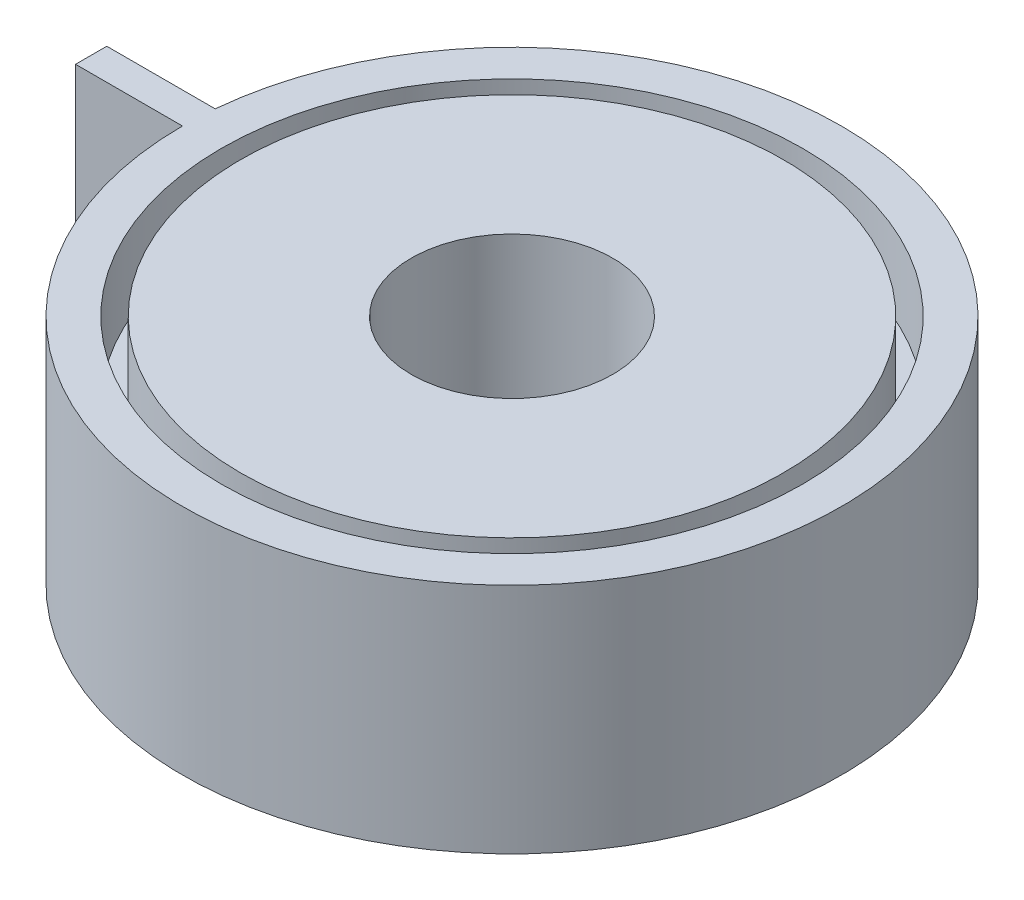
ISO-10303-21;
HEADER;
FILE_DESCRIPTION(('STEP AP214'),'2;1');
FILE_NAME('part.step','',(''),(''),'','','');
FILE_SCHEMA(('AUTOMOTIVE_DESIGN { 1 0 10303 214 1 1 1 1 }'));
ENDSEC;
DATA;
#1=APPLICATION_CONTEXT('core data for automotive mechanical design processes');
#2=APPLICATION_PROTOCOL_DEFINITION('international standard','automotive_design',2000,#1);
#3=PRODUCT_CONTEXT('',#1,'mechanical');
#4=PRODUCT('Part','Part','',(#3));
#5=PRODUCT_RELATED_PRODUCT_CATEGORY('part','',(#4));
#6=PRODUCT_DEFINITION_FORMATION('','',#4);
#7=PRODUCT_DEFINITION_CONTEXT('part definition',#1,'design');
#8=PRODUCT_DEFINITION('design','',#6,#7);
#9=PRODUCT_DEFINITION_SHAPE('','',#8);
#10=(LENGTH_UNIT() NAMED_UNIT(*) SI_UNIT(.MILLI.,.METRE.));
#11=(NAMED_UNIT(*) PLANE_ANGLE_UNIT() SI_UNIT($,.RADIAN.));
#12=(NAMED_UNIT(*) SI_UNIT($,.STERADIAN.) SOLID_ANGLE_UNIT());
#13=UNCERTAINTY_MEASURE_WITH_UNIT(LENGTH_MEASURE(1.E-05),#10,'distance_accuracy_value','');
#14=(GEOMETRIC_REPRESENTATION_CONTEXT(3) GLOBAL_UNCERTAINTY_ASSIGNED_CONTEXT((#13)) GLOBAL_UNIT_ASSIGNED_CONTEXT((#10,
#11,#12)) REPRESENTATION_CONTEXT('',''));
#15=CARTESIAN_POINT('',(0.,0.,0.));
#16=DIRECTION('',(0.,0.,1.));
#17=DIRECTION('',(1.,0.,0.));
#18=AXIS2_PLACEMENT_3D('',#15,#16,#17);
#19=CARTESIAN_POINT('',(0.,60.,0.));
#20=DIRECTION('',(0.,1.,0.));
#21=DIRECTION('',(0.,0.,1.));
#22=AXIS2_PLACEMENT_3D('',#19,#20,#21);
#23=PLANE('',#22);
#24=CARTESIAN_POINT('',(0.,60.,0.));
#25=DIRECTION('',(0.,1.,0.));
#26=DIRECTION('',(0.,0.,1.));
#27=AXIS2_PLACEMENT_3D('',#24,#25,#26);
#28=CIRCLE('',#27,26.);
#29=CARTESIAN_POINT('',(0.,60.,26.));
#30=VERTEX_POINT('',#29);
#31=EDGE_CURVE('E128',#30,#30,#28,.T.);
#32=ORIENTED_EDGE('',*,*,#31,.F.);
#33=EDGE_LOOP('',(#32));
#34=FACE_BOUND('',#33,.T.);
#35=CARTESIAN_POINT('',(0.,60.,0.));
#36=DIRECTION('',(0.,1.,0.));
#37=DIRECTION('',(0.,0.,1.));
#38=AXIS2_PLACEMENT_3D('',#35,#36,#37);
#39=CIRCLE('',#38,70.);
#40=CARTESIAN_POINT('',(0.,60.,70.));
#41=VERTEX_POINT('',#40);
#42=EDGE_CURVE('E177',#41,#41,#39,.T.);
#43=ORIENTED_EDGE('',*,*,#42,.T.);
#44=EDGE_LOOP('',(#43));
#45=FACE_BOUND('',#44,.T.);
#46=ADVANCED_FACE('F55',(#34,#45),#23,.T.);
#47=CARTESIAN_POINT('',(0.,0.,0.));
#48=DIRECTION('',(0.,1.,0.));
#49=DIRECTION('',(0.,0.,1.));
#50=AXIS2_PLACEMENT_3D('',#47,#48,#49);
#51=PLANE('',#50);
#52=CARTESIAN_POINT('',(0.,0.,0.));
#53=DIRECTION('',(0.,1.,0.));
#54=DIRECTION('',(0.,0.,1.));
#55=AXIS2_PLACEMENT_3D('',#52,#53,#54);
#56=CIRCLE('',#55,26.);
#57=CARTESIAN_POINT('',(0.,0.,26.));
#58=VERTEX_POINT('',#57);
#59=EDGE_CURVE('E145',#58,#58,#56,.T.);
#60=ORIENTED_EDGE('',*,*,#59,.T.);
#61=EDGE_LOOP('',(#60));
#62=FACE_BOUND('',#61,.T.);
#63=CARTESIAN_POINT('',(0.,0.,0.));
#64=DIRECTION('',(0.,-1.,0.));
#65=DIRECTION('',(0.,0.,-1.));
#66=AXIS2_PLACEMENT_3D('',#63,#64,#65);
#67=CIRCLE('',#66,70.);
#68=CARTESIAN_POINT('',(0.,0.,-70.));
#69=VERTEX_POINT('',#68);
#70=EDGE_CURVE('E161',#69,#69,#67,.T.);
#71=ORIENTED_EDGE('',*,*,#70,.T.);
#72=EDGE_LOOP('',(#71));
#73=FACE_BOUND('',#72,.T.);
#74=ADVANCED_FACE('F202',(#62,#73),#51,.F.);
#75=CARTESIAN_POINT('',(0.,60.,0.));
#76=DIRECTION('',(0.,1.,0.));
#77=DIRECTION('',(0.,0.,1.));
#78=AXIS2_PLACEMENT_3D('',#75,#76,#77);
#79=CIRCLE('',#78,75.);
#80=CARTESIAN_POINT('',(0.,60.,75.));
#81=VERTEX_POINT('',#80);
#82=EDGE_CURVE('E169',#81,#81,#79,.T.);
#83=ORIENTED_EDGE('',*,*,#82,.F.);
#84=EDGE_LOOP('',(#83));
#85=FACE_BOUND('',#84,.T.);
#86=CARTESIAN_POINT('',(0.,60.,0.));
#87=DIRECTION('',(0.,1.,0.));
#88=DIRECTION('',(0.,0.,1.));
#89=AXIS2_PLACEMENT_3D('',#86,#87,#88);
#90=CIRCLE('',#89,85.);
#91=CARTESIAN_POINT('',(-85.,60.,0.));
#92=VERTEX_POINT('',#91);
#93=CARTESIAN_POINT('',(-84.6170668633372,60.,-8.05928008233536));
#94=VERTEX_POINT('',#93);
#95=EDGE_CURVE('E108',#92,#94,#90,.T.);
#96=ORIENTED_EDGE('',*,*,#95,.T.);
#97=DIRECTION('',(-1.,0.,0.));
#98=VECTOR('',#97,1.);
#99=CARTESIAN_POINT('',(-112.580048143794,60.,-8.05928008233536));
#100=LINE('',#99,#98);
#101=CARTESIAN_POINT('',(-112.580048143794,60.,-8.05928008233536));
#102=VERTEX_POINT('',#101);
#103=EDGE_CURVE('E103',#94,#102,#100,.T.);
#104=ORIENTED_EDGE('',*,*,#103,.T.);
#105=DIRECTION('',(0.,0.,1.));
#106=VECTOR('',#105,1.);
#107=CARTESIAN_POINT('',(-112.580048143794,60.,0.));
#108=LINE('',#107,#106);
#109=CARTESIAN_POINT('',(-112.580048143794,60.,0.));
#110=VERTEX_POINT('',#109);
#111=EDGE_CURVE('E106',#102,#110,#108,.T.);
#112=ORIENTED_EDGE('',*,*,#111,.T.);
#113=DIRECTION('',(1.,0.,0.));
#114=VECTOR('',#113,1.);
#115=CARTESIAN_POINT('',(-85.,60.,0.));
#116=LINE('',#115,#114);
#117=EDGE_CURVE('E73',#110,#92,#116,.T.);
#118=ORIENTED_EDGE('',*,*,#117,.T.);
#119=EDGE_LOOP('',(#96,#104,#112,#118));
#120=FACE_BOUND('',#119,.T.);
#121=ADVANCED_FACE('F104',(#85,#120),#23,.T.);
#122=CARTESIAN_POINT('',(0.,0.,0.));
#123=DIRECTION('',(0.,-1.,0.));
#124=DIRECTION('',(0.,0.,-1.));
#125=AXIS2_PLACEMENT_3D('',#122,#123,#124);
#126=CIRCLE('',#125,75.);
#127=CARTESIAN_POINT('',(0.,0.,-75.));
#128=VERTEX_POINT('',#127);
#129=EDGE_CURVE('E153',#128,#128,#126,.T.);
#130=ORIENTED_EDGE('',*,*,#129,.F.);
#131=EDGE_LOOP('',(#130));
#132=FACE_BOUND('',#131,.T.);
#133=CARTESIAN_POINT('',(0.,0.,0.));
#134=DIRECTION('',(0.,1.,0.));
#135=DIRECTION('',(0.,0.,1.));
#136=AXIS2_PLACEMENT_3D('',#133,#134,#135);
#137=CIRCLE('',#136,85.);
#138=CARTESIAN_POINT('',(-85.,0.,0.));
#139=VERTEX_POINT('',#138);
#140=CARTESIAN_POINT('',(-84.6170668633372,0.,-8.05928008233536));
#141=VERTEX_POINT('',#140);
#142=EDGE_CURVE('E124',#139,#141,#137,.T.);
#143=ORIENTED_EDGE('',*,*,#142,.F.);
#144=DIRECTION('',(1.,0.,0.));
#145=VECTOR('',#144,1.);
#146=CARTESIAN_POINT('',(-85.,0.,0.));
#147=LINE('',#146,#145);
#148=CARTESIAN_POINT('',(-112.580048143794,0.,0.));
#149=VERTEX_POINT('',#148);
#150=EDGE_CURVE('E96',#149,#139,#147,.T.);
#151=ORIENTED_EDGE('',*,*,#150,.F.);
#152=DIRECTION('',(0.,0.,1.));
#153=VECTOR('',#152,1.);
#154=CARTESIAN_POINT('',(-112.580048143794,0.,0.));
#155=LINE('',#154,#153);
#156=CARTESIAN_POINT('',(-112.580048143794,0.,-8.05928008233536));
#157=VERTEX_POINT('',#156);
#158=EDGE_CURVE('E90',#157,#149,#155,.T.);
#159=ORIENTED_EDGE('',*,*,#158,.F.);
#160=DIRECTION('',(-1.,0.,0.));
#161=VECTOR('',#160,1.);
#162=CARTESIAN_POINT('',(-112.580048143794,0.,-8.05928008233536));
#163=LINE('',#162,#161);
#164=EDGE_CURVE('E113',#141,#157,#163,.T.);
#165=ORIENTED_EDGE('',*,*,#164,.F.);
#166=EDGE_LOOP('',(#143,#151,#159,#165));
#167=FACE_BOUND('',#166,.T.);
#168=ADVANCED_FACE('F141',(#132,#167),#51,.F.);
#169=CARTESIAN_POINT('',(0.,60.,0.));
#170=DIRECTION('',(0.,-1.,0.));
#171=DIRECTION('',(0.,0.,-1.));
#172=AXIS2_PLACEMENT_3D('',#169,#170,#171);
#173=CYLINDRICAL_SURFACE('',#172,85.);
#174=ORIENTED_EDGE('',*,*,#142,.T.);
#175=DIRECTION('',(0.,-1.,0.));
#176=VECTOR('',#175,1.);
#177=CARTESIAN_POINT('',(-84.6170668633372,60.,-8.05928008233536));
#178=LINE('',#177,#176);
#179=EDGE_CURVE('E12',#94,#141,#178,.T.);
#180=ORIENTED_EDGE('',*,*,#179,.F.);
#181=ORIENTED_EDGE('',*,*,#95,.F.);
#182=DIRECTION('',(0.,-1.,0.));
#183=VECTOR('',#182,1.);
#184=CARTESIAN_POINT('',(-85.,60.,0.));
#185=LINE('',#184,#183);
#186=EDGE_CURVE('E120',#92,#139,#185,.T.);
#187=ORIENTED_EDGE('',*,*,#186,.T.);
#188=EDGE_LOOP('',(#174,#180,#181,#187));
#189=FACE_BOUND('',#188,.T.);
#190=ADVANCED_FACE('F57',(#189),#173,.T.);
#191=CARTESIAN_POINT('',(-112.580048143794,60.,-8.05928008233536));
#192=DIRECTION('',(0.,0.,1.));
#193=DIRECTION('',(1.,0.,0.));
#194=AXIS2_PLACEMENT_3D('',#191,#192,#193);
#195=PLANE('',#194);
#196=ORIENTED_EDGE('',*,*,#164,.T.);
#197=DIRECTION('',(0.,-1.,0.));
#198=VECTOR('',#197,1.);
#199=CARTESIAN_POINT('',(-112.580048143794,60.,-8.05928008233536));
#200=LINE('',#199,#198);
#201=EDGE_CURVE('E65',#102,#157,#200,.T.);
#202=ORIENTED_EDGE('',*,*,#201,.F.);
#203=ORIENTED_EDGE('',*,*,#103,.F.);
#204=ORIENTED_EDGE('',*,*,#179,.T.);
#205=EDGE_LOOP('',(#196,#202,#203,#204));
#206=FACE_BOUND('',#205,.T.);
#207=ADVANCED_FACE('F112',(#206),#195,.F.);
#208=CARTESIAN_POINT('',(-112.580048143794,60.,0.));
#209=DIRECTION('',(1.,0.,0.));
#210=DIRECTION('',(0.,0.,-1.));
#211=AXIS2_PLACEMENT_3D('',#208,#209,#210);
#212=PLANE('',#211);
#213=ORIENTED_EDGE('',*,*,#158,.T.);
#214=DIRECTION('',(0.,-1.,0.));
#215=VECTOR('',#214,1.);
#216=CARTESIAN_POINT('',(-112.580048143794,60.,0.));
#217=LINE('',#216,#215);
#218=EDGE_CURVE('E115',#110,#149,#217,.T.);
#219=ORIENTED_EDGE('',*,*,#218,.F.);
#220=ORIENTED_EDGE('',*,*,#111,.F.);
#221=ORIENTED_EDGE('',*,*,#201,.T.);
#222=EDGE_LOOP('',(#213,#219,#220,#221));
#223=FACE_BOUND('',#222,.T.);
#224=ADVANCED_FACE('F116',(#223),#212,.F.);
#225=CARTESIAN_POINT('',(-85.,60.,0.));
#226=DIRECTION('',(0.,0.,-1.));
#227=DIRECTION('',(-1.,0.,0.));
#228=AXIS2_PLACEMENT_3D('',#225,#226,#227);
#229=PLANE('',#228);
#230=ORIENTED_EDGE('',*,*,#150,.T.);
#231=ORIENTED_EDGE('',*,*,#186,.F.);
#232=ORIENTED_EDGE('',*,*,#117,.F.);
#233=ORIENTED_EDGE('',*,*,#218,.T.);
#234=EDGE_LOOP('',(#230,#231,#232,#233));
#235=FACE_BOUND('',#234,.T.);
#236=ADVANCED_FACE('F138',(#235),#229,.F.);
#237=CARTESIAN_POINT('',(0.,60.,0.));
#238=DIRECTION('',(0.,-1.,0.));
#239=DIRECTION('',(0.,0.,-1.));
#240=AXIS2_PLACEMENT_3D('',#237,#238,#239);
#241=CYLINDRICAL_SURFACE('',#240,26.);
#242=ORIENTED_EDGE('',*,*,#31,.T.);
#243=EDGE_LOOP('',(#242));
#244=FACE_BOUND('',#243,.T.);
#245=ORIENTED_EDGE('',*,*,#59,.F.);
#246=EDGE_LOOP('',(#245));
#247=FACE_BOUND('',#246,.T.);
#248=ADVANCED_FACE('F233',(#244,#247),#241,.F.);
#249=CARTESIAN_POINT('',(0.,20.,0.));
#250=DIRECTION('',(0.,-1.,0.));
#251=DIRECTION('',(0.,0.,-1.));
#252=AXIS2_PLACEMENT_3D('',#249,#250,#251);
#253=CYLINDRICAL_SURFACE('',#252,75.);
#254=CARTESIAN_POINT('',(0.,20.,0.));
#255=DIRECTION('',(0.,-1.,0.));
#256=DIRECTION('',(0.,0.,-1.));
#257=AXIS2_PLACEMENT_3D('',#254,#255,#256);
#258=CIRCLE('',#257,75.);
#259=CARTESIAN_POINT('',(0.,20.,-75.));
#260=VERTEX_POINT('',#259);
#261=EDGE_CURVE('E149',#260,#260,#258,.T.);
#262=ORIENTED_EDGE('',*,*,#261,.F.);
#263=EDGE_LOOP('',(#262));
#264=FACE_BOUND('',#263,.T.);
#265=ORIENTED_EDGE('',*,*,#129,.T.);
#266=EDGE_LOOP('',(#265));
#267=FACE_BOUND('',#266,.T.);
#268=ADVANCED_FACE('F230',(#264,#267),#253,.F.);
#269=CARTESIAN_POINT('',(0.,20.,0.));
#270=DIRECTION('',(0.,-1.,0.));
#271=DIRECTION('',(0.,0.,-1.));
#272=AXIS2_PLACEMENT_3D('',#269,#270,#271);
#273=PLANE('',#272);
#274=CARTESIAN_POINT('',(0.,20.,0.));
#275=DIRECTION('',(0.,-1.,0.));
#276=DIRECTION('',(0.,0.,-1.));
#277=AXIS2_PLACEMENT_3D('',#274,#275,#276);
#278=CIRCLE('',#277,70.);
#279=CARTESIAN_POINT('',(0.,20.,-70.));
#280=VERTEX_POINT('',#279);
#281=EDGE_CURVE('E157',#280,#280,#278,.T.);
#282=ORIENTED_EDGE('',*,*,#281,.F.);
#283=EDGE_LOOP('',(#282));
#284=FACE_BOUND('',#283,.T.);
#285=ORIENTED_EDGE('',*,*,#261,.T.);
#286=EDGE_LOOP('',(#285));
#287=FACE_BOUND('',#286,.T.);
#288=ADVANCED_FACE('F226',(#284,#287),#273,.T.);
#289=CARTESIAN_POINT('',(0.,20.,0.));
#290=DIRECTION('',(0.,-1.,0.));
#291=DIRECTION('',(0.,0.,-1.));
#292=AXIS2_PLACEMENT_3D('',#289,#290,#291);
#293=CYLINDRICAL_SURFACE('',#292,70.);
#294=ORIENTED_EDGE('',*,*,#281,.T.);
#295=EDGE_LOOP('',(#294));
#296=FACE_BOUND('',#295,.T.);
#297=ORIENTED_EDGE('',*,*,#70,.F.);
#298=EDGE_LOOP('',(#297));
#299=FACE_BOUND('',#298,.T.);
#300=ADVANCED_FACE('F197',(#296,#299),#293,.T.);
#301=CARTESIAN_POINT('',(0.,40.,0.));
#302=DIRECTION('',(0.,1.,0.));
#303=DIRECTION('',(0.,0.,1.));
#304=AXIS2_PLACEMENT_3D('',#301,#302,#303);
#305=CYLINDRICAL_SURFACE('',#304,75.);
#306=CARTESIAN_POINT('',(0.,40.,0.));
#307=DIRECTION('',(0.,1.,0.));
#308=DIRECTION('',(0.,0.,1.));
#309=AXIS2_PLACEMENT_3D('',#306,#307,#308);
#310=CIRCLE('',#309,75.);
#311=CARTESIAN_POINT('',(0.,40.,75.));
#312=VERTEX_POINT('',#311);
#313=EDGE_CURVE('E165',#312,#312,#310,.T.);
#314=ORIENTED_EDGE('',*,*,#313,.F.);
#315=EDGE_LOOP('',(#314));
#316=FACE_BOUND('',#315,.T.);
#317=ORIENTED_EDGE('',*,*,#82,.T.);
#318=EDGE_LOOP('',(#317));
#319=FACE_BOUND('',#318,.T.);
#320=ADVANCED_FACE('F191',(#316,#319),#305,.F.);
#321=CARTESIAN_POINT('',(0.,40.,0.));
#322=DIRECTION('',(0.,1.,0.));
#323=DIRECTION('',(0.,0.,1.));
#324=AXIS2_PLACEMENT_3D('',#321,#322,#323);
#325=PLANE('',#324);
#326=CARTESIAN_POINT('',(0.,40.,0.));
#327=DIRECTION('',(0.,1.,0.));
#328=DIRECTION('',(0.,0.,1.));
#329=AXIS2_PLACEMENT_3D('',#326,#327,#328);
#330=CIRCLE('',#329,70.);
#331=CARTESIAN_POINT('',(0.,40.,70.));
#332=VERTEX_POINT('',#331);
#333=EDGE_CURVE('E173',#332,#332,#330,.T.);
#334=ORIENTED_EDGE('',*,*,#333,.F.);
#335=EDGE_LOOP('',(#334));
#336=FACE_BOUND('',#335,.T.);
#337=ORIENTED_EDGE('',*,*,#313,.T.);
#338=EDGE_LOOP('',(#337));
#339=FACE_BOUND('',#338,.T.);
#340=ADVANCED_FACE('F188',(#336,#339),#325,.T.);
#341=CARTESIAN_POINT('',(0.,40.,0.));
#342=DIRECTION('',(0.,1.,0.));
#343=DIRECTION('',(0.,0.,1.));
#344=AXIS2_PLACEMENT_3D('',#341,#342,#343);
#345=CYLINDRICAL_SURFACE('',#344,70.);
#346=ORIENTED_EDGE('',*,*,#333,.T.);
#347=EDGE_LOOP('',(#346));
#348=FACE_BOUND('',#347,.T.);
#349=ORIENTED_EDGE('',*,*,#42,.F.);
#350=EDGE_LOOP('',(#349));
#351=FACE_BOUND('',#350,.T.);
#352=ADVANCED_FACE('F185',(#348,#351),#345,.T.);
#353=CLOSED_SHELL('',(#46,#74,#121,#168,#190,#207,#224,#236,#248,#268,#288,#300,#320,#340,#352));
#354=MANIFOLD_SOLID_BREP('B2',#353);
#355=ADVANCED_BREP_SHAPE_REPRESENTATION('',(#18,#354),#14);
#356=SHAPE_DEFINITION_REPRESENTATION(#9,#355);
ENDSEC;
END-ISO-10303-21;
